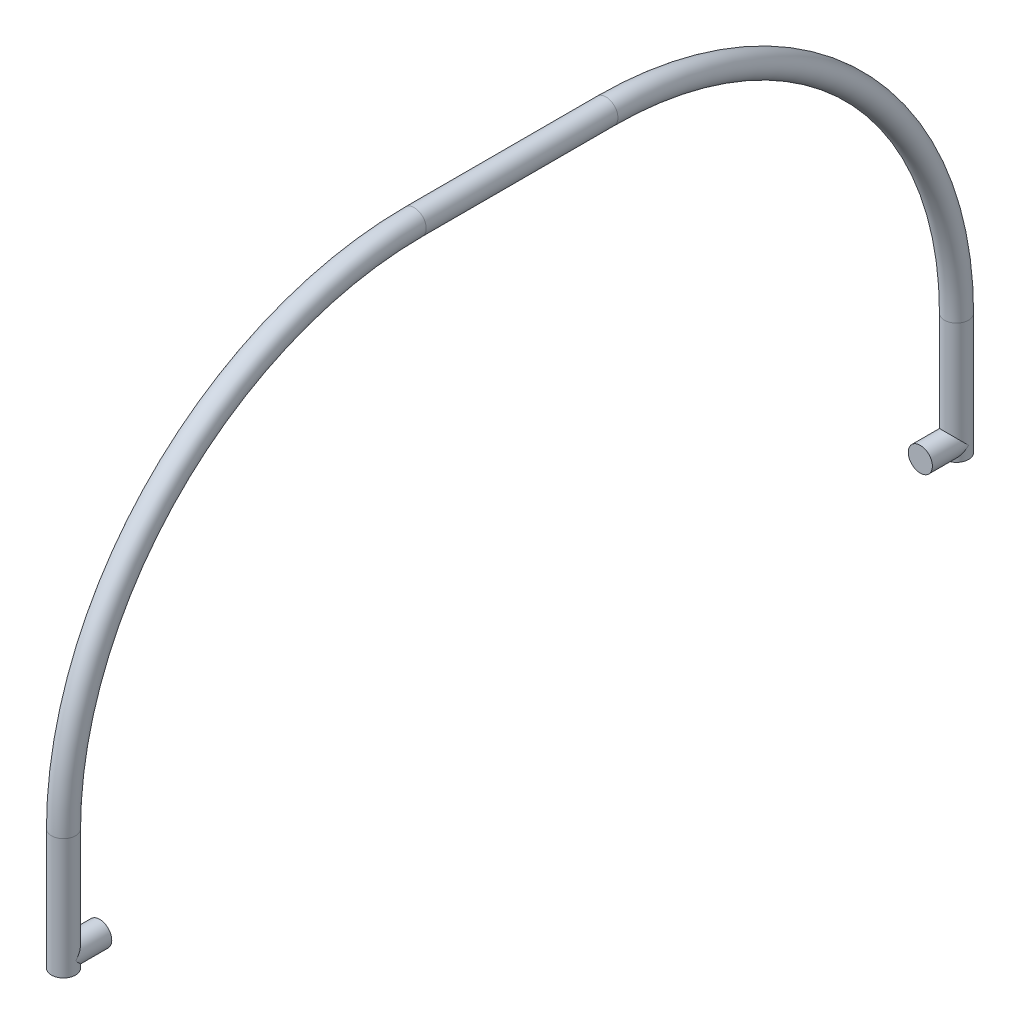
ISO-10303-21;
HEADER;
FILE_DESCRIPTION(('STEP AP214'),'2;1');
FILE_NAME('part.step','',(''),(''),'','','');
FILE_SCHEMA(('AUTOMOTIVE_DESIGN { 1 0 10303 214 1 1 1 1 }'));
ENDSEC;
DATA;
#1=APPLICATION_CONTEXT('core data for automotive mechanical design processes');
#2=APPLICATION_PROTOCOL_DEFINITION('international standard','automotive_design',2000,#1);
#3=PRODUCT_CONTEXT('',#1,'mechanical');
#4=PRODUCT('Part','Part','',(#3));
#5=PRODUCT_RELATED_PRODUCT_CATEGORY('part','',(#4));
#6=PRODUCT_DEFINITION_FORMATION('','',#4);
#7=PRODUCT_DEFINITION_CONTEXT('part definition',#1,'design');
#8=PRODUCT_DEFINITION('design','',#6,#7);
#9=PRODUCT_DEFINITION_SHAPE('','',#8);
#10=(LENGTH_UNIT() NAMED_UNIT(*) SI_UNIT(.MILLI.,.METRE.));
#11=(NAMED_UNIT(*) PLANE_ANGLE_UNIT() SI_UNIT($,.RADIAN.));
#12=(NAMED_UNIT(*) SI_UNIT($,.STERADIAN.) SOLID_ANGLE_UNIT());
#13=UNCERTAINTY_MEASURE_WITH_UNIT(LENGTH_MEASURE(1.E-05),#10,'distance_accuracy_value','');
#14=(GEOMETRIC_REPRESENTATION_CONTEXT(3) GLOBAL_UNCERTAINTY_ASSIGNED_CONTEXT((#13)) GLOBAL_UNIT_ASSIGNED_CONTEXT((#10,
#11,#12)) REPRESENTATION_CONTEXT('',''));
#15=CARTESIAN_POINT('',(0.,0.,0.));
#16=DIRECTION('',(0.,0.,1.));
#17=DIRECTION('',(1.,0.,0.));
#18=AXIS2_PLACEMENT_3D('',#15,#16,#17);
#19=CARTESIAN_POINT('',(0.,5.03172825382196,170.));
#20=DIRECTION('',(0.,0.,1.));
#21=DIRECTION('',(1.,0.,0.));
#22=AXIS2_PLACEMENT_3D('',#19,#20,#21);
#23=CYLINDRICAL_SURFACE('',#22,5.);
#24=CARTESIAN_POINT('',(0.,5.03172825382196,170.));
#25=DIRECTION('',(0.,0.,1.));
#26=DIRECTION('',(1.,0.,0.));
#27=AXIS2_PLACEMENT_3D('',#24,#25,#26);
#28=CIRCLE('',#27,5.);
#29=CARTESIAN_POINT('',(5.,5.03172825382196,170.));
#30=VERTEX_POINT('',#29);
#31=EDGE_CURVE('E12',#30,#30,#28,.T.);
#32=ORIENTED_EDGE('',*,*,#31,.T.);
#33=EDGE_LOOP('',(#32));
#34=FACE_BOUND('',#33,.T.);
#35=CARTESIAN_POINT('',(0.,5.03172825382196,185.));
#36=DIRECTION('',(0.,-0.707106781186548,-0.707106781186547));
#37=DIRECTION('',(0.,0.707106781186547,-0.707106781186548));
#38=AXIS2_PLACEMENT_3D('',#35,#36,#37);
#39=ELLIPSE('',#38,7.07106781186548,5.);
#40=CARTESIAN_POINT('',(5.,5.03172825382196,185.));
#41=VERTEX_POINT('',#40);
#42=CARTESIAN_POINT('',(-5.,5.03172825382196,185.));
#43=VERTEX_POINT('',#42);
#44=EDGE_CURVE('E58',#41,#43,#39,.F.);
#45=ORIENTED_EDGE('',*,*,#44,.F.);
#46=CARTESIAN_POINT('',(0.,5.03172825382196,185.));
#47=DIRECTION('',(0.,0.707106781186547,-0.707106781186548));
#48=DIRECTION('',(0.,-0.707106781186548,-0.707106781186547));
#49=AXIS2_PLACEMENT_3D('',#46,#47,#48);
#50=ELLIPSE('',#49,7.07106781186548,5.);
#51=EDGE_CURVE('E66',#43,#41,#50,.F.);
#52=ORIENTED_EDGE('',*,*,#51,.F.);
#53=EDGE_LOOP('',(#45,#52));
#54=FACE_BOUND('',#53,.T.);
#55=ADVANCED_FACE('F51',(#34,#54),#23,.T.);
#56=CARTESIAN_POINT('',(0.,5.03172825382196,170.));
#57=DIRECTION('',(0.,0.,1.));
#58=DIRECTION('',(1.,0.,0.));
#59=AXIS2_PLACEMENT_3D('',#56,#57,#58);
#60=PLANE('',#59);
#61=ORIENTED_EDGE('',*,*,#31,.F.);
#62=EDGE_LOOP('',(#61));
#63=FACE_BOUND('',#62,.T.);
#64=ADVANCED_FACE('F70',(#63),#60,.F.);
#65=CARTESIAN_POINT('',(0.,6.16173778666962E-13,185.));
#66=DIRECTION('',(0.,1.,0.));
#67=DIRECTION('',(0.,0.,1.));
#68=AXIS2_PLACEMENT_3D('',#65,#66,#67);
#69=CYLINDRICAL_SURFACE('',#68,5.);
#70=ORIENTED_EDGE('',*,*,#51,.T.);
#71=ORIENTED_EDGE('',*,*,#44,.T.);
#72=EDGE_LOOP('',(#70,#71));
#73=FACE_BOUND('',#72,.T.);
#74=ADVANCED_FACE('F68',(#73),#69,.F.);
#75=CLOSED_SHELL('',(#55,#64,#74));
#76=MANIFOLD_SOLID_BREP('B2',#75);
#77=CARTESIAN_POINT('',(0.,50.,-185.));
#78=DIRECTION('',(0.,-1.,0.));
#79=DIRECTION('',(0.,0.,-1.));
#80=AXIS2_PLACEMENT_3D('',#77,#78,#79);
#81=CYLINDRICAL_SURFACE('',#80,5.);
#82=CARTESIAN_POINT('',(0.,50.0000000000004,-185.));
#83=DIRECTION('',(0.,1.,0.));
#84=DIRECTION('',(0.,0.,1.));
#85=AXIS2_PLACEMENT_3D('',#82,#83,#84);
#86=CIRCLE('',#85,5.);
#87=CARTESIAN_POINT('',(0.,50.0000000000004,-190.));
#88=VERTEX_POINT('',#87);
#89=EDGE_CURVE('E110',#88,#88,#86,.T.);
#90=ORIENTED_EDGE('',*,*,#89,.F.);
#91=EDGE_LOOP('',(#90));
#92=FACE_BOUND('',#91,.T.);
#93=CARTESIAN_POINT('',(0.,0.,-185.));
#94=DIRECTION('',(0.,1.,0.));
#95=DIRECTION('',(0.,0.,1.));
#96=AXIS2_PLACEMENT_3D('',#93,#94,#95);
#97=CIRCLE('',#96,5.);
#98=CARTESIAN_POINT('',(0.,0.,-180.));
#99=VERTEX_POINT('',#98);
#100=EDGE_CURVE('E49',#99,#99,#97,.T.);
#101=ORIENTED_EDGE('',*,*,#100,.T.);
#102=EDGE_LOOP('',(#101));
#103=FACE_BOUND('',#102,.T.);
#104=CARTESIAN_POINT('',(0.,5.11060558253048,-185.));
#105=DIRECTION('',(0.,0.707106781186547,0.707106781186548));
#106=DIRECTION('',(0.,-0.707106781186548,0.707106781186547));
#107=AXIS2_PLACEMENT_3D('',#104,#105,#106);
#108=ELLIPSE('',#107,7.07106781186547,5.);
#109=CARTESIAN_POINT('',(-5.,5.11060558253048,-185.));
#110=VERTEX_POINT('',#109);
#111=CARTESIAN_POINT('',(5.,5.11060558253048,-185.));
#112=VERTEX_POINT('',#111);
#113=EDGE_CURVE('E118',#110,#112,#108,.T.);
#114=ORIENTED_EDGE('',*,*,#113,.F.);
#115=CARTESIAN_POINT('',(0.,5.11060558253048,-185.));
#116=DIRECTION('',(0.,-0.707106781186548,0.707106781186547));
#117=DIRECTION('',(0.,0.707106781186547,0.707106781186548));
#118=AXIS2_PLACEMENT_3D('',#115,#116,#117);
#119=ELLIPSE('',#118,7.07106781186549,5.);
#120=EDGE_CURVE('E116',#112,#110,#119,.T.);
#121=ORIENTED_EDGE('',*,*,#120,.F.);
#122=EDGE_LOOP('',(#114,#121));
#123=FACE_BOUND('',#122,.T.);
#124=ADVANCED_FACE('F101',(#92,#103,#123),#81,.T.);
#125=CARTESIAN_POINT('',(0.,6.16173778666962E-13,185.));
#126=DIRECTION('',(0.,-1.,0.));
#127=DIRECTION('',(0.,0.,-1.));
#128=AXIS2_PLACEMENT_3D('',#125,#126,#127);
#129=PLANE('',#128);
#130=CARTESIAN_POINT('',(0.,6.16173778666962E-13,185.));
#131=DIRECTION('',(0.,-1.,0.));
#132=DIRECTION('',(0.,0.,-1.));
#133=AXIS2_PLACEMENT_3D('',#130,#131,#132);
#134=CIRCLE('',#133,5.);
#135=CARTESIAN_POINT('',(0.,5.99520433297585E-13,180.));
#136=VERTEX_POINT('',#135);
#137=EDGE_CURVE('E130',#136,#136,#134,.T.);
#138=ORIENTED_EDGE('',*,*,#137,.T.);
#139=EDGE_LOOP('',(#138));
#140=FACE_BOUND('',#139,.T.);
#141=ADVANCED_FACE('F103',(#140),#129,.T.);
#142=CARTESIAN_POINT('',(0.,0.,-185.));
#143=DIRECTION('',(0.,1.,0.));
#144=DIRECTION('',(0.,0.,1.));
#145=AXIS2_PLACEMENT_3D('',#142,#143,#144);
#146=PLANE('',#145);
#147=ORIENTED_EDGE('',*,*,#100,.F.);
#148=EDGE_LOOP('',(#147));
#149=FACE_BOUND('',#148,.T.);
#150=ADVANCED_FACE('F157',(#149),#146,.F.);
#151=CARTESIAN_POINT('',(0.,6.16173778666962E-13,185.));
#152=DIRECTION('',(0.,1.,0.));
#153=DIRECTION('',(0.,0.,1.));
#154=AXIS2_PLACEMENT_3D('',#151,#152,#153);
#155=CYLINDRICAL_SURFACE('',#154,5.);
#156=CARTESIAN_POINT('',(0.,50.,185.));
#157=DIRECTION('',(0.,-1.,0.));
#158=DIRECTION('',(0.,0.,-1.));
#159=AXIS2_PLACEMENT_3D('',#156,#157,#158);
#160=CIRCLE('',#159,5.);
#161=CARTESIAN_POINT('',(0.,50.,190.));
#162=VERTEX_POINT('',#161);
#163=EDGE_CURVE('E134',#162,#162,#160,.T.);
#164=ORIENTED_EDGE('',*,*,#163,.T.);
#165=EDGE_LOOP('',(#164));
#166=FACE_BOUND('',#165,.T.);
#167=ORIENTED_EDGE('',*,*,#137,.F.);
#168=EDGE_LOOP('',(#167));
#169=FACE_BOUND('',#168,.T.);
#170=ADVANCED_FACE('F159',(#166,#169),#155,.T.);
#171=CARTESIAN_POINT('',(0.,50.,39.7196131278912));
#172=DIRECTION('',(-1.,0.,0.));
#173=DIRECTION('',(0.,0.,1.));
#174=AXIS2_PLACEMENT_3D('',#171,#172,#173);
#175=TOROIDAL_SURFACE('',#174,145.280386872109,5.);
#176=CARTESIAN_POINT('',(0.,195.280386872109,39.7196131278911));
#177=DIRECTION('',(0.,0.,1.));
#178=DIRECTION('',(0.,-1.,0.));
#179=AXIS2_PLACEMENT_3D('',#176,#177,#178);
#180=CIRCLE('',#179,5.);
#181=CARTESIAN_POINT('',(0.,200.280386872109,39.7196131278911));
#182=VERTEX_POINT('',#181);
#183=EDGE_CURVE('E138',#182,#182,#180,.T.);
#184=CARTESIAN_POINT('',(0.,50.,39.7196131278912));
#185=DIRECTION('',(-1.,0.,0.));
#186=DIRECTION('',(0.,0.,1.));
#187=AXIS2_PLACEMENT_3D('',#184,#185,#186);
#188=CIRCLE('',#187,150.280386872109);
#189=EDGE_CURVE('',#162,#182,#188,.T.);
#190=ORIENTED_EDGE('',*,*,#163,.F.);
#191=ORIENTED_EDGE('',*,*,#183,.T.);
#192=ORIENTED_EDGE('',*,*,#189,.T.);
#193=ORIENTED_EDGE('',*,*,#189,.F.);
#194=EDGE_LOOP('',(#190,#192,#191,#193));
#195=FACE_BOUND('',#194,.T.);
#196=ADVANCED_FACE('F164',(#195),#175,.T.);
#197=CARTESIAN_POINT('',(0.,195.280386872109,39.7196131278911));
#198=DIRECTION('',(0.,0.,-1.));
#199=DIRECTION('',(-1.,0.,0.));
#200=AXIS2_PLACEMENT_3D('',#197,#198,#199);
#201=CYLINDRICAL_SURFACE('',#200,5.);
#202=CARTESIAN_POINT('',(0.,195.280386872109,-39.7196131278912));
#203=DIRECTION('',(0.,0.,1.));
#204=DIRECTION('',(0.,-1.,0.));
#205=AXIS2_PLACEMENT_3D('',#202,#203,#204);
#206=CIRCLE('',#205,5.);
#207=CARTESIAN_POINT('',(0.,200.280386872109,-39.7196131278912));
#208=VERTEX_POINT('',#207);
#209=EDGE_CURVE('E142',#208,#208,#206,.T.);
#210=ORIENTED_EDGE('',*,*,#209,.T.);
#211=EDGE_LOOP('',(#210));
#212=FACE_BOUND('',#211,.T.);
#213=ORIENTED_EDGE('',*,*,#183,.F.);
#214=EDGE_LOOP('',(#213));
#215=FACE_BOUND('',#214,.T.);
#216=ADVANCED_FACE('F171',(#212,#215),#201,.T.);
#217=CARTESIAN_POINT('',(0.,50.,-39.7196131278912));
#218=DIRECTION('',(-1.,0.,0.));
#219=DIRECTION('',(0.,0.,1.));
#220=AXIS2_PLACEMENT_3D('',#217,#218,#219);
#221=TOROIDAL_SURFACE('',#220,145.280386872109,5.);
#222=CARTESIAN_POINT('',(0.,50.,-39.7196131278912));
#223=DIRECTION('',(-1.,0.,0.));
#224=DIRECTION('',(0.,0.,1.));
#225=AXIS2_PLACEMENT_3D('',#222,#223,#224);
#226=CIRCLE('',#225,150.280386872109);
#227=EDGE_CURVE('',#208,#88,#226,.T.);
#228=ORIENTED_EDGE('',*,*,#209,.F.);
#229=ORIENTED_EDGE('',*,*,#89,.T.);
#230=ORIENTED_EDGE('',*,*,#227,.T.);
#231=ORIENTED_EDGE('',*,*,#227,.F.);
#232=EDGE_LOOP('',(#228,#230,#229,#231));
#233=FACE_BOUND('',#232,.T.);
#234=ADVANCED_FACE('F149',(#233),#221,.T.);
#235=CARTESIAN_POINT('',(0.,5.11060558253048,-170.));
#236=DIRECTION('',(0.,0.,-1.));
#237=DIRECTION('',(-1.,0.,0.));
#238=AXIS2_PLACEMENT_3D('',#235,#236,#237);
#239=CYLINDRICAL_SURFACE('',#238,5.);
#240=CARTESIAN_POINT('',(0.,5.11060558253048,-170.));
#241=DIRECTION('',(0.,0.,1.));
#242=DIRECTION('',(1.,0.,0.));
#243=AXIS2_PLACEMENT_3D('',#240,#241,#242);
#244=CIRCLE('',#243,5.);
#245=CARTESIAN_POINT('',(5.,5.11060558253048,-170.));
#246=VERTEX_POINT('',#245);
#247=EDGE_CURVE('E121',#246,#246,#244,.T.);
#248=ORIENTED_EDGE('',*,*,#247,.F.);
#249=EDGE_LOOP('',(#248));
#250=FACE_BOUND('',#249,.T.);
#251=ORIENTED_EDGE('',*,*,#113,.T.);
#252=ORIENTED_EDGE('',*,*,#120,.T.);
#253=EDGE_LOOP('',(#251,#252));
#254=FACE_BOUND('',#253,.T.);
#255=ADVANCED_FACE('F123',(#250,#254),#239,.T.);
#256=CARTESIAN_POINT('',(0.,5.11060558253048,-170.));
#257=DIRECTION('',(0.,0.,1.));
#258=DIRECTION('',(1.,0.,0.));
#259=AXIS2_PLACEMENT_3D('',#256,#257,#258);
#260=PLANE('',#259);
#261=ORIENTED_EDGE('',*,*,#247,.T.);
#262=EDGE_LOOP('',(#261));
#263=FACE_BOUND('',#262,.T.);
#264=ADVANCED_FACE('F180',(#263),#260,.T.);
#265=CLOSED_SHELL('',(#124,#141,#150,#170,#196,#216,#234,#255,#264));
#266=MANIFOLD_SOLID_BREP('B6',#265);
#267=ADVANCED_BREP_SHAPE_REPRESENTATION('',(#18,#76,#266),#14);
#268=SHAPE_DEFINITION_REPRESENTATION(#9,#267);
ENDSEC;
END-ISO-10303-21;
